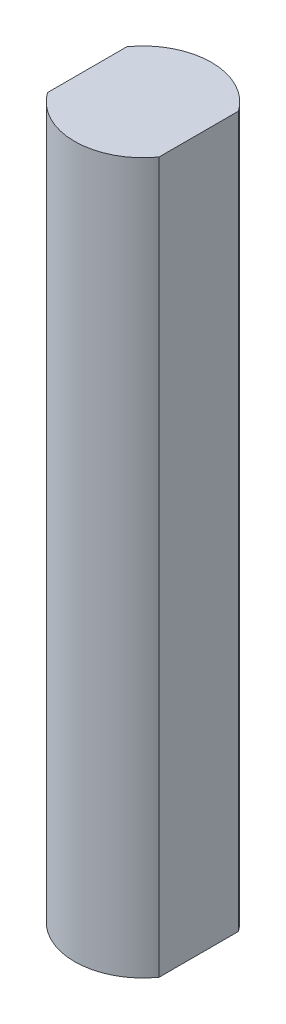
ISO-10303-21;
HEADER;
FILE_DESCRIPTION(('STEP AP214'),'2;1');
FILE_NAME('part.step','',(''),(''),'','','');
FILE_SCHEMA(('AUTOMOTIVE_DESIGN { 1 0 10303 214 1 1 1 1 }'));
ENDSEC;
DATA;
#1=APPLICATION_CONTEXT('core data for automotive mechanical design processes');
#2=APPLICATION_PROTOCOL_DEFINITION('international standard','automotive_design',2000,#1);
#3=PRODUCT_CONTEXT('',#1,'mechanical');
#4=PRODUCT('Part','Part','',(#3));
#5=PRODUCT_RELATED_PRODUCT_CATEGORY('part','',(#4));
#6=PRODUCT_DEFINITION_FORMATION('','',#4);
#7=PRODUCT_DEFINITION_CONTEXT('part definition',#1,'design');
#8=PRODUCT_DEFINITION('design','',#6,#7);
#9=PRODUCT_DEFINITION_SHAPE('','',#8);
#10=(LENGTH_UNIT() NAMED_UNIT(*) SI_UNIT(.MILLI.,.METRE.));
#11=(NAMED_UNIT(*) PLANE_ANGLE_UNIT() SI_UNIT($,.RADIAN.));
#12=(NAMED_UNIT(*) SI_UNIT($,.STERADIAN.) SOLID_ANGLE_UNIT());
#13=UNCERTAINTY_MEASURE_WITH_UNIT(LENGTH_MEASURE(1.E-05),#10,'distance_accuracy_value','');
#14=(GEOMETRIC_REPRESENTATION_CONTEXT(3) GLOBAL_UNCERTAINTY_ASSIGNED_CONTEXT((#13)) GLOBAL_UNIT_ASSIGNED_CONTEXT((#10,
#11,#12)) REPRESENTATION_CONTEXT('',''));
#15=CARTESIAN_POINT('',(0.,0.,0.));
#16=DIRECTION('',(0.,0.,1.));
#17=DIRECTION('',(1.,0.,0.));
#18=AXIS2_PLACEMENT_3D('',#15,#16,#17);
#19=CARTESIAN_POINT('',(0.,45.466,0.));
#20=DIRECTION('',(0.,-1.,0.));
#21=DIRECTION('',(0.,0.,-1.));
#22=AXIS2_PLACEMENT_3D('',#19,#20,#21);
#23=CYLINDRICAL_SURFACE('',#22,4.3815);
#24=DIRECTION('',(0.,1.,0.));
#25=VECTOR('',#24,1.);
#26=CARTESIAN_POINT('',(-3.57014597040513,-2.794,-2.54));
#27=LINE('',#26,#25);
#28=CARTESIAN_POINT('',(-3.57014597040513,0.,-2.54));
#29=VERTEX_POINT('',#28);
#30=CARTESIAN_POINT('',(-3.57014597040513,45.466,-2.54));
#31=VERTEX_POINT('',#30);
#32=EDGE_CURVE('E48',#29,#31,#27,.T.);
#33=ORIENTED_EDGE('',*,*,#32,.T.);
#34=CARTESIAN_POINT('',(0.,45.466,0.));
#35=DIRECTION('',(0.,1.,0.));
#36=DIRECTION('',(0.,0.,1.));
#37=AXIS2_PLACEMENT_3D('',#34,#35,#36);
#38=CIRCLE('',#37,4.3815);
#39=CARTESIAN_POINT('',(3.57014597040513,45.466,-2.54));
#40=VERTEX_POINT('',#39);
#41=EDGE_CURVE('E85',#40,#31,#38,.T.);
#42=ORIENTED_EDGE('',*,*,#41,.F.);
#43=DIRECTION('',(0.,1.,0.));
#44=VECTOR('',#43,1.);
#45=CARTESIAN_POINT('',(3.57014597040513,-2.794,-2.54));
#46=LINE('',#45,#44);
#47=CARTESIAN_POINT('',(3.57014597040513,0.,-2.54));
#48=VERTEX_POINT('',#47);
#49=EDGE_CURVE('E96',#48,#40,#46,.T.);
#50=ORIENTED_EDGE('',*,*,#49,.F.);
#51=CARTESIAN_POINT('',(0.,0.,0.));
#52=DIRECTION('',(0.,1.,0.));
#53=DIRECTION('',(0.,0.,1.));
#54=AXIS2_PLACEMENT_3D('',#51,#52,#53);
#55=CIRCLE('',#54,4.3815);
#56=EDGE_CURVE('E87',#48,#29,#55,.T.);
#57=ORIENTED_EDGE('',*,*,#56,.T.);
#58=EDGE_LOOP('',(#33,#42,#50,#57));
#59=FACE_BOUND('',#58,.T.);
#60=ADVANCED_FACE('F35',(#59),#23,.T.);
#61=DIRECTION('',(0.,1.,0.));
#62=VECTOR('',#61,1.);
#63=CARTESIAN_POINT('',(-3.57014597040513,-2.794,2.54));
#64=LINE('',#63,#62);
#65=CARTESIAN_POINT('',(-3.57014597040513,0.,2.54));
#66=VERTEX_POINT('',#65);
#67=CARTESIAN_POINT('',(-3.57014597040513,45.466,2.54));
#68=VERTEX_POINT('',#67);
#69=EDGE_CURVE('E75',#66,#68,#64,.T.);
#70=ORIENTED_EDGE('',*,*,#69,.F.);
#71=CARTESIAN_POINT('',(3.57014597040513,0.,2.54));
#72=VERTEX_POINT('',#71);
#73=EDGE_CURVE('E98',#66,#72,#55,.T.);
#74=ORIENTED_EDGE('',*,*,#73,.T.);
#75=DIRECTION('',(0.,1.,0.));
#76=VECTOR('',#75,1.);
#77=CARTESIAN_POINT('',(3.57014597040513,-2.794,2.54));
#78=LINE('',#77,#76);
#79=CARTESIAN_POINT('',(3.57014597040513,45.466,2.54));
#80=VERTEX_POINT('',#79);
#81=EDGE_CURVE('E56',#72,#80,#78,.T.);
#82=ORIENTED_EDGE('',*,*,#81,.T.);
#83=EDGE_CURVE('E92',#68,#80,#38,.T.);
#84=ORIENTED_EDGE('',*,*,#83,.F.);
#85=EDGE_LOOP('',(#70,#74,#82,#84));
#86=FACE_BOUND('',#85,.T.);
#87=ADVANCED_FACE('F107',(#86),#23,.T.);
#88=CARTESIAN_POINT('',(0.,45.466,0.));
#89=DIRECTION('',(0.,1.,0.));
#90=DIRECTION('',(0.,0.,1.));
#91=AXIS2_PLACEMENT_3D('',#88,#89,#90);
#92=PLANE('',#91);
#93=ORIENTED_EDGE('',*,*,#41,.T.);
#94=DIRECTION('',(0.,0.,1.));
#95=VECTOR('',#94,1.);
#96=CARTESIAN_POINT('',(-3.57014597040513,45.466,0.));
#97=LINE('',#96,#95);
#98=EDGE_CURVE('E72',#31,#68,#97,.T.);
#99=ORIENTED_EDGE('',*,*,#98,.T.);
#100=ORIENTED_EDGE('',*,*,#83,.T.);
#101=DIRECTION('',(0.,0.,1.));
#102=VECTOR('',#101,1.);
#103=CARTESIAN_POINT('',(3.57014597040513,45.466,0.));
#104=LINE('',#103,#102);
#105=EDGE_CURVE('E91',#40,#80,#104,.T.);
#106=ORIENTED_EDGE('',*,*,#105,.F.);
#107=EDGE_LOOP('',(#93,#99,#100,#106));
#108=FACE_BOUND('',#107,.T.);
#109=ADVANCED_FACE('F90',(#108),#92,.T.);
#110=CARTESIAN_POINT('',(0.,0.,0.));
#111=DIRECTION('',(0.,1.,0.));
#112=DIRECTION('',(0.,0.,1.));
#113=AXIS2_PLACEMENT_3D('',#110,#111,#112);
#114=PLANE('',#113);
#115=DIRECTION('',(0.,0.,1.));
#116=VECTOR('',#115,1.);
#117=CARTESIAN_POINT('',(-3.57014597040513,0.,0.));
#118=LINE('',#117,#116);
#119=EDGE_CURVE('E11',#29,#66,#118,.T.);
#120=ORIENTED_EDGE('',*,*,#119,.F.);
#121=ORIENTED_EDGE('',*,*,#56,.F.);
#122=DIRECTION('',(0.,0.,1.));
#123=VECTOR('',#122,1.);
#124=CARTESIAN_POINT('',(3.57014597040513,0.,0.));
#125=LINE('',#124,#123);
#126=EDGE_CURVE('E42',#48,#72,#125,.T.);
#127=ORIENTED_EDGE('',*,*,#126,.T.);
#128=ORIENTED_EDGE('',*,*,#73,.F.);
#129=EDGE_LOOP('',(#120,#121,#127,#128));
#130=FACE_BOUND('',#129,.T.);
#131=ADVANCED_FACE('F106',(#130),#114,.F.);
#132=CARTESIAN_POINT('',(3.57014597040513,-2.794,0.));
#133=DIRECTION('',(-1.,0.,0.));
#134=DIRECTION('',(0.,0.,1.));
#135=AXIS2_PLACEMENT_3D('',#132,#133,#134);
#136=PLANE('',#135);
#137=ORIENTED_EDGE('',*,*,#49,.T.);
#138=ORIENTED_EDGE('',*,*,#105,.T.);
#139=ORIENTED_EDGE('',*,*,#81,.F.);
#140=ORIENTED_EDGE('',*,*,#126,.F.);
#141=EDGE_LOOP('',(#137,#138,#139,#140));
#142=FACE_BOUND('',#141,.T.);
#143=ADVANCED_FACE('F104',(#142),#136,.F.);
#144=CARTESIAN_POINT('',(-3.57014597040513,-2.794,0.));
#145=DIRECTION('',(-1.,0.,0.));
#146=DIRECTION('',(0.,0.,1.));
#147=AXIS2_PLACEMENT_3D('',#144,#145,#146);
#148=PLANE('',#147);
#149=ORIENTED_EDGE('',*,*,#119,.T.);
#150=ORIENTED_EDGE('',*,*,#69,.T.);
#151=ORIENTED_EDGE('',*,*,#98,.F.);
#152=ORIENTED_EDGE('',*,*,#32,.F.);
#153=EDGE_LOOP('',(#149,#150,#151,#152));
#154=FACE_BOUND('',#153,.T.);
#155=ADVANCED_FACE('F73',(#154),#148,.T.);
#156=CLOSED_SHELL('',(#60,#87,#109,#131,#143,#155));
#157=MANIFOLD_SOLID_BREP('B2',#156);
#158=ADVANCED_BREP_SHAPE_REPRESENTATION('',(#18,#157),#14);
#159=SHAPE_DEFINITION_REPRESENTATION(#9,#158);
ENDSEC;
END-ISO-10303-21;
